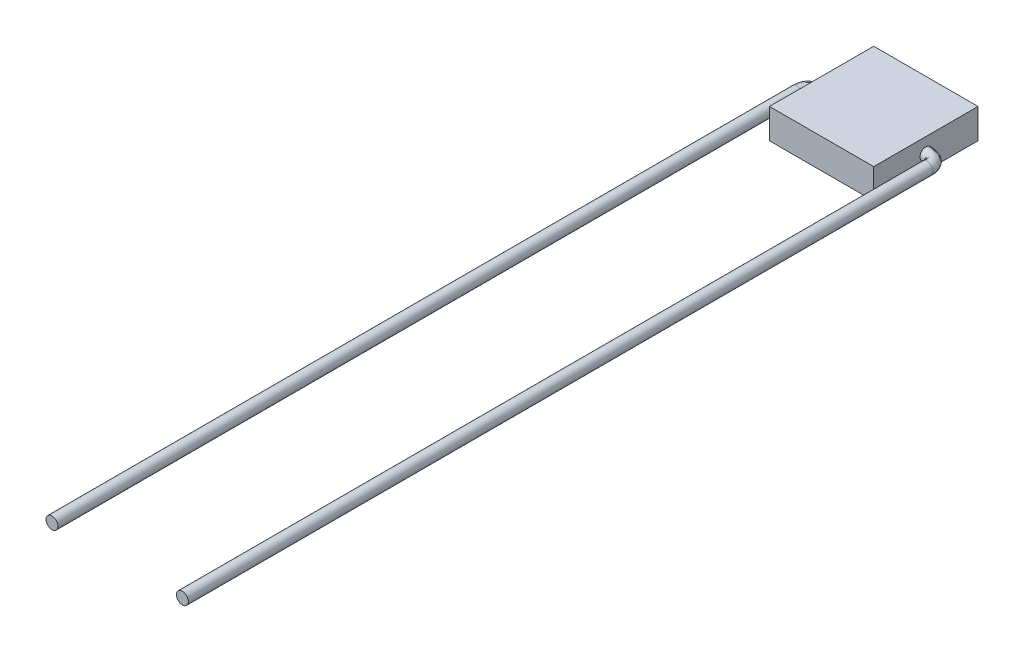
ISO-10303-21;
HEADER;
FILE_DESCRIPTION(('STEP AP214'),'2;1');
FILE_NAME('part.step','',(''),(''),'','','');
FILE_SCHEMA(('AUTOMOTIVE_DESIGN { 1 0 10303 214 1 1 1 1 }'));
ENDSEC;
DATA;
#1=APPLICATION_CONTEXT('core data for automotive mechanical design processes');
#2=APPLICATION_PROTOCOL_DEFINITION('international standard','automotive_design',2000,#1);
#3=PRODUCT_CONTEXT('',#1,'mechanical');
#4=PRODUCT('Part','Part','',(#3));
#5=PRODUCT_RELATED_PRODUCT_CATEGORY('part','',(#4));
#6=PRODUCT_DEFINITION_FORMATION('','',#4);
#7=PRODUCT_DEFINITION_CONTEXT('part definition',#1,'design');
#8=PRODUCT_DEFINITION('design','',#6,#7);
#9=PRODUCT_DEFINITION_SHAPE('','',#8);
#10=(LENGTH_UNIT() NAMED_UNIT(*) SI_UNIT(.MILLI.,.METRE.));
#11=(NAMED_UNIT(*) PLANE_ANGLE_UNIT() SI_UNIT($,.RADIAN.));
#12=(NAMED_UNIT(*) SI_UNIT($,.STERADIAN.) SOLID_ANGLE_UNIT());
#13=UNCERTAINTY_MEASURE_WITH_UNIT(LENGTH_MEASURE(1.E-05),#10,'distance_accuracy_value','');
#14=(GEOMETRIC_REPRESENTATION_CONTEXT(3) GLOBAL_UNCERTAINTY_ASSIGNED_CONTEXT((#13)) GLOBAL_UNIT_ASSIGNED_CONTEXT((#10,
#11,#12)) REPRESENTATION_CONTEXT('',''));
#15=CARTESIAN_POINT('',(0.,0.,0.));
#16=DIRECTION('',(0.,0.,1.));
#17=DIRECTION('',(1.,0.,0.));
#18=AXIS2_PLACEMENT_3D('',#15,#16,#17);
#19=CARTESIAN_POINT('',(-3.501,1.,-0.399999999999999));
#20=CARTESIAN_POINT('',(-3.56646782600625,1.,-0.39755730411981));
#21=CARTESIAN_POINT('',(-3.69185284114559,1.,-0.39287901436128));
#22=CARTESIAN_POINT('',(-3.88118886321808,1.,-0.364493104213795));
#23=CARTESIAN_POINT('',(-4.06161080445499,1.,-0.316892142088519));
#24=CARTESIAN_POINT('',(-4.23312358370174,1.,-0.245077929609848));
#25=CARTESIAN_POINT('',(-4.39217712534511,1.,-0.145202077715626));
#26=CARTESIAN_POINT('',(-4.53978133452972,1.,-0.00812376183653443));
#27=CARTESIAN_POINT('',(-4.66190402129707,1.,0.169362084409235));
#28=CARTESIAN_POINT('',(-4.74252724949883,1.,0.377519920231313));
#29=CARTESIAN_POINT('',(-4.78088929752952,1.,0.595196422765956));
#30=CARTESIAN_POINT('',(-4.77817081920847,1.,0.733264586087936));
#31=CARTESIAN_POINT('',(-4.77675207461588,1.,0.805320875301515));
#32=CARTESIAN_POINT('',(-3.501,1.8,-0.399999999999999));
#33=CARTESIAN_POINT('',(-3.56646782600626,1.8,-0.39755730411981));
#34=CARTESIAN_POINT('',(-3.69185284114559,1.8,-0.39287901436128));
#35=CARTESIAN_POINT('',(-3.88118886321808,1.8,-0.364493104213795));
#36=CARTESIAN_POINT('',(-4.06161080445499,1.8,-0.316892142088519));
#37=CARTESIAN_POINT('',(-4.23312358370174,1.8,-0.245077929609848));
#38=CARTESIAN_POINT('',(-4.39217712534511,1.8,-0.145202077715626));
#39=CARTESIAN_POINT('',(-4.53978133452972,1.8,-0.0081237618365347));
#40=CARTESIAN_POINT('',(-4.66190402129707,1.8,0.169362084409235));
#41=CARTESIAN_POINT('',(-4.74252724949883,1.8,0.377519920231313));
#42=CARTESIAN_POINT('',(-4.78088929752952,1.8,0.595196422765956));
#43=CARTESIAN_POINT('',(-4.77817081920847,1.8,0.733264586087936));
#44=CARTESIAN_POINT('',(-4.77675207461588,1.8,0.805320875301515));
#45=CARTESIAN_POINT('',(-3.501,1.8,0.400000000000001));
#46=CARTESIAN_POINT('',(-3.54524047836114,1.8,0.402052575954826));
#47=CARTESIAN_POINT('',(-3.62997054177509,1.8,0.405983701866138));
#48=CARTESIAN_POINT('',(-3.73669676239041,1.8,0.424079368187305));
#49=CARTESIAN_POINT('',(-3.81920029534562,1.8,0.448162313815962));
#50=CARTESIAN_POINT('',(-3.87711121417875,1.8,0.475402874293346));
#51=CARTESIAN_POINT('',(-3.91364694425438,1.8,0.50178322862157));
#52=CARTESIAN_POINT('',(-3.93670395517712,1.8,0.527297192400344));
#53=CARTESIAN_POINT('',(-3.95340882564816,1.8,0.555945947624282));
#54=CARTESIAN_POINT('',(-3.96924981858099,1.8,0.602357223756058));
#55=CARTESIAN_POINT('',(-3.98113071589947,1.8,0.675492594266937));
#56=CARTESIAN_POINT('',(-3.97846976825326,1.8,0.744618866099475));
#57=CARTESIAN_POINT('',(-3.97708104830101,1.8,0.780695123765089));
#58=CARTESIAN_POINT('',(-3.501,1.,0.400000000000001));
#59=CARTESIAN_POINT('',(-3.54524047836114,1.,0.402052575954826));
#60=CARTESIAN_POINT('',(-3.62997054177509,1.,0.405983701866138));
#61=CARTESIAN_POINT('',(-3.73669676239041,1.,0.424079368187305));
#62=CARTESIAN_POINT('',(-3.81920029534563,1.,0.448162313815961));
#63=CARTESIAN_POINT('',(-3.87711121417874,1.,0.475402874293346));
#64=CARTESIAN_POINT('',(-3.91364694425438,1.,0.501783228621569));
#65=CARTESIAN_POINT('',(-3.93670395517712,1.,0.527297192400344));
#66=CARTESIAN_POINT('',(-3.95340882564816,1.,0.555945947624282));
#67=CARTESIAN_POINT('',(-3.96924981858099,1.,0.602357223756058));
#68=CARTESIAN_POINT('',(-3.98113071589947,1.,0.675492594266937));
#69=CARTESIAN_POINT('',(-3.97846976825326,1.,0.744618866099475));
#70=CARTESIAN_POINT('',(-3.97708104830101,1.,0.780695123765089));
#71=CARTESIAN_POINT('',(-3.501,0.2,0.400000000000001));
#72=CARTESIAN_POINT('',(-3.54524047836114,0.2,0.402052575954826));
#73=CARTESIAN_POINT('',(-3.62997054177509,0.2,0.405983701866138));
#74=CARTESIAN_POINT('',(-3.73669676239041,0.2,0.424079368187305));
#75=CARTESIAN_POINT('',(-3.81920029534562,0.2,0.448162313815962));
#76=CARTESIAN_POINT('',(-3.87711121417875,0.2,0.475402874293346));
#77=CARTESIAN_POINT('',(-3.91364694425438,0.2,0.50178322862157));
#78=CARTESIAN_POINT('',(-3.93670395517712,0.2,0.527297192400344));
#79=CARTESIAN_POINT('',(-3.95340882564816,0.2,0.555945947624283));
#80=CARTESIAN_POINT('',(-3.96924981858099,0.2,0.602357223756057));
#81=CARTESIAN_POINT('',(-3.98113071589947,0.2,0.675492594266937));
#82=CARTESIAN_POINT('',(-3.97846976825326,0.2,0.744618866099475));
#83=CARTESIAN_POINT('',(-3.97708104830101,0.2,0.780695123765089));
#84=CARTESIAN_POINT('',(-3.501,0.2,-0.399999999999999));
#85=CARTESIAN_POINT('',(-3.56646782600626,0.2,-0.39755730411981));
#86=CARTESIAN_POINT('',(-3.69185284114559,0.2,-0.39287901436128));
#87=CARTESIAN_POINT('',(-3.88118886321808,0.2,-0.364493104213795));
#88=CARTESIAN_POINT('',(-4.06161080445499,0.2,-0.316892142088519));
#89=CARTESIAN_POINT('',(-4.23312358370174,0.2,-0.245077929609848));
#90=CARTESIAN_POINT('',(-4.39217712534511,0.2,-0.145202077715626));
#91=CARTESIAN_POINT('',(-4.53978133452972,0.2,-0.0081237618365347));
#92=CARTESIAN_POINT('',(-4.66190402129707,0.2,0.169362084409235));
#93=CARTESIAN_POINT('',(-4.74252724949883,0.2,0.377519920231313));
#94=CARTESIAN_POINT('',(-4.78088929752952,0.2,0.595196422765956));
#95=CARTESIAN_POINT('',(-4.77817081920847,0.2,0.733264586087936));
#96=CARTESIAN_POINT('',(-4.77675207461588,0.2,0.805320875301515));
#97=CARTESIAN_POINT('',(-3.501,1.,-0.399999999999999));
#98=CARTESIAN_POINT('',(-3.56646782600625,1.,-0.39755730411981));
#99=CARTESIAN_POINT('',(-3.69185284114559,1.,-0.39287901436128));
#100=CARTESIAN_POINT('',(-3.88118886321808,1.,-0.364493104213795));
#101=CARTESIAN_POINT('',(-4.06161080445499,1.,-0.316892142088519));
#102=CARTESIAN_POINT('',(-4.23312358370174,1.,-0.245077929609848));
#103=CARTESIAN_POINT('',(-4.39217712534511,1.,-0.145202077715626));
#104=CARTESIAN_POINT('',(-4.53978133452972,1.,-0.00812376183653443));
#105=CARTESIAN_POINT('',(-4.66190402129707,1.,0.169362084409235));
#106=CARTESIAN_POINT('',(-4.74252724949883,1.,0.377519920231313));
#107=CARTESIAN_POINT('',(-4.78088929752952,1.,0.595196422765956));
#108=CARTESIAN_POINT('',(-4.77817081920847,1.,0.733264586087936));
#109=CARTESIAN_POINT('',(-4.77675207461588,1.,0.805320875301515));
#110=(BOUNDED_SURFACE() B_SPLINE_SURFACE(3,3,((#19,#20,#21,#22,#23,#24,#25,#26,#27,#28,#29,#30,
#31),(#32,#33,#34,#35,#36,#37,#38,#39,#40,#41,#42,#43,#44),(#45,#46,#47,#48,#49,#50,#51,#52,#53,
#54,#55,#56,#57),(#58,#59,#60,#61,#62,#63,#64,#65,#66,#67,#68,#69,#70),(#71,#72,#73,#74,#75,#76,
#77,#78,#79,#80,#81,#82,#83),(#84,#85,#86,#87,#88,#89,#90,#91,#92,#93,#94,#95,#96),(#97,#98,#99,
#100,#101,#102,#103,#104,#105,#106,#107,#108,#109)),.UNSPECIFIED.,.T.,.F.,
.F.) B_SPLINE_SURFACE_WITH_KNOTS((4,3,4),(4,1,1,1,1,1,1,1,1,1,4),(0.,0.5,1.),(0.,
0.116131357521181,0.222416611474986,0.320137404051586,0.410906732244125,0.496658547709349,
0.579566355450047,0.676689324838823,0.776806012198351,0.883517458704345,1.),
.UNSPECIFIED.) GEOMETRIC_REPRESENTATION_ITEM() RATIONAL_B_SPLINE_SURFACE(((1.,1.,1.,1.,1.,1.,1.,
1.,1.,1.,1.,1.,1.),(0.333333333333333,0.333333333333333,0.333333333333333,0.333333333333333,
0.333333333333333,0.333333333333333,0.333333333333333,0.333333333333333,0.333333333333333,
0.333333333333333,0.333333333333333,0.333333333333333,0.333333333333333),(0.333333333333333,
0.333333333333333,0.333333333333333,0.333333333333333,0.333333333333333,0.333333333333333,
0.333333333333333,0.333333333333333,0.333333333333333,0.333333333333333,0.333333333333333,
0.333333333333333,0.333333333333333),(1.,1.,1.,1.,1.,1.,1.,1.,1.,1.,1.,1.,1.),
(0.333333333333333,0.333333333333333,0.333333333333333,0.333333333333333,0.333333333333333,
0.333333333333333,0.333333333333333,0.333333333333333,0.333333333333333,0.333333333333333,
0.333333333333333,0.333333333333333,0.333333333333333),(0.333333333333333,0.333333333333333,
0.333333333333333,0.333333333333333,0.333333333333333,0.333333333333333,0.333333333333333,
0.333333333333333,0.333333333333333,0.333333333333333,0.333333333333333,0.333333333333333,
0.333333333333333),(1.,1.,1.,1.,1.,1.,1.,1.,1.,1.,1.,1.,1.))) REPRESENTATION_ITEM('') SURFACE());
#111=CARTESIAN_POINT('',(-3.501,1.,0.));
#112=DIRECTION('',(1.,0.,0.));
#113=DIRECTION('',(0.,0.,-1.));
#114=AXIS2_PLACEMENT_3D('',#111,#112,#113);
#115=CIRCLE('',#114,0.4);
#116=CARTESIAN_POINT('',(-3.501,1.,-0.399999999999999));
#117=VERTEX_POINT('',#116);
#118=EDGE_CURVE('E13',#117,#117,#115,.T.);
#119=CARTESIAN_POINT('',(-4.77675207461588,1.,0.805320875301515));
#120=CARTESIAN_POINT('',(-4.77675207461588,0.2,0.805320875301515));
#121=CARTESIAN_POINT('',(-3.97708104830101,0.2,0.780695123765089));
#122=CARTESIAN_POINT('',(-3.97708104830101,1.,0.780695123765089));
#123=CARTESIAN_POINT('',(-3.97708104830101,1.8,0.780695123765089));
#124=CARTESIAN_POINT('',(-4.77675207461588,1.8,0.805320875301515));
#125=CARTESIAN_POINT('',(-4.77675207461588,1.,0.805320875301515));
#126=(BOUNDED_CURVE() B_SPLINE_CURVE(3,(#119,#120,#121,#122,#123,#124,#125),.UNSPECIFIED.,.T.,
.F.) B_SPLINE_CURVE_WITH_KNOTS((4,3,4),(0.,0.5,1.),
.UNSPECIFIED.) CURVE() GEOMETRIC_REPRESENTATION_ITEM() RATIONAL_B_SPLINE_CURVE((1.,
0.333333333333333,0.333333333333333,1.,0.333333333333333,0.333333333333333,1.)) REPRESENTATION_ITEM(''));
#127=CARTESIAN_POINT('',(-4.77675207461588,1.,0.805320875301515));
#128=VERTEX_POINT('',#127);
#129=EDGE_CURVE('E70',#128,#128,#126,.T.);
#130=ORIENTED_EDGE('',*,*,#118,.F.);
#131=EDGE_LOOP('',(#130));
#132=FACE_BOUND('',#131,.T.);
#133=ORIENTED_EDGE('',*,*,#129,.F.);
#134=EDGE_LOOP('',(#133));
#135=FACE_BOUND('',#134,.T.);
#136=ADVANCED_FACE('F58',(#132,#135),#110,.F.);
#137=CARTESIAN_POINT('',(-3.501,1.,0.));
#138=DIRECTION('',(-1.,0.,0.));
#139=DIRECTION('',(0.,0.,-1.));
#140=AXIS2_PLACEMENT_3D('',#137,#138,#139);
#141=PLANE('',#140);
#142=ORIENTED_EDGE('',*,*,#118,.T.);
#143=EDGE_LOOP('',(#142));
#144=FACE_BOUND('',#143,.T.);
#145=ADVANCED_FACE('F90',(#144),#141,.F.);
#146=CARTESIAN_POINT('',(-3.97708104830101,1.,50.7930079995333));
#147=DIRECTION('',(0.,0.,1.));
#148=DIRECTION('',(-1.,0.,0.));
#149=AXIS2_PLACEMENT_3D('',#146,#147,#148);
#150=PLANE('',#149);
#151=CARTESIAN_POINT('',(-4.77675207461588,1.,50.7930079995333));
#152=CARTESIAN_POINT('',(-4.77675207461588,0.2,50.7930079995333));
#153=CARTESIAN_POINT('',(-3.977081048301,0.2,50.7930079995333));
#154=CARTESIAN_POINT('',(-3.97708104830101,1.,50.7930079995333));
#155=CARTESIAN_POINT('',(-3.977081048301,1.8,50.7930079995333));
#156=CARTESIAN_POINT('',(-4.77675207461588,1.8,50.7930079995333));
#157=CARTESIAN_POINT('',(-4.77675207461588,1.,50.7930079995333));
#158=(BOUNDED_CURVE() B_SPLINE_CURVE(3,(#151,#152,#153,#154,#155,#156,#157),.UNSPECIFIED.,.T.,
.F.) B_SPLINE_CURVE_WITH_KNOTS((4,3,4),(0.,0.5,1.),
.UNSPECIFIED.) CURVE() GEOMETRIC_REPRESENTATION_ITEM() RATIONAL_B_SPLINE_CURVE((1.,
0.333333333333333,0.333333333333333,1.,0.333333333333333,0.333333333333333,1.)) REPRESENTATION_ITEM(''));
#159=CARTESIAN_POINT('',(-4.77675207461588,1.,50.7930079995333));
#160=VERTEX_POINT('',#159);
#161=EDGE_CURVE('E66',#160,#160,#158,.F.);
#162=ORIENTED_EDGE('',*,*,#161,.F.);
#163=EDGE_LOOP('',(#162));
#164=FACE_BOUND('',#163,.T.);
#165=ADVANCED_FACE('F95',(#164),#150,.T.);
#166=CARTESIAN_POINT('',(-4.77675207461588,1.,0.805320875301515));
#167=CARTESIAN_POINT('',(-4.77675207461588,1.,50.7930079995333));
#168=CARTESIAN_POINT('',(-4.77675207461588,0.2,0.805320875301515));
#169=CARTESIAN_POINT('',(-4.77675207461588,0.2,50.7930079995333));
#170=CARTESIAN_POINT('',(-3.97708104830101,0.2,0.780695123765089));
#171=CARTESIAN_POINT('',(-3.977081048301,0.2,50.7930079995333));
#172=CARTESIAN_POINT('',(-3.97708104830101,1.,0.780695123765089));
#173=CARTESIAN_POINT('',(-3.97708104830101,1.,50.7930079995333));
#174=CARTESIAN_POINT('',(-3.97708104830101,1.8,0.780695123765089));
#175=CARTESIAN_POINT('',(-3.977081048301,1.8,50.7930079995333));
#176=CARTESIAN_POINT('',(-4.77675207461588,1.8,0.805320875301515));
#177=CARTESIAN_POINT('',(-4.77675207461588,1.8,50.7930079995333));
#178=CARTESIAN_POINT('',(-4.77675207461588,1.,0.805320875301515));
#179=CARTESIAN_POINT('',(-4.77675207461588,1.,50.7930079995333));
#180=(BOUNDED_SURFACE() B_SPLINE_SURFACE(3,1,((#166,#167),(#168,#169),(#170,#171),(#172,#173),
(#174,#175),(#176,#177),(#178,#179)),.UNSPECIFIED.,.T.,.F.,.F.) B_SPLINE_SURFACE_WITH_KNOTS((4,
3,4),(2,2),(0.,0.5,1.),(0.,1.),
.UNSPECIFIED.) GEOMETRIC_REPRESENTATION_ITEM() RATIONAL_B_SPLINE_SURFACE(((1.,1.),
(0.333333333333333,0.333333333333333),(0.333333333333333,0.333333333333333),(1.,1.),
(0.333333333333333,0.333333333333333),(0.333333333333333,0.333333333333333),(1.,1.))) REPRESENTATION_ITEM('') SURFACE());
#181=ORIENTED_EDGE('',*,*,#129,.T.);
#182=EDGE_LOOP('',(#181));
#183=FACE_BOUND('',#182,.T.);
#184=ORIENTED_EDGE('',*,*,#161,.T.);
#185=EDGE_LOOP('',(#184));
#186=FACE_BOUND('',#185,.T.);
#187=ADVANCED_FACE('F87',(#183,#186),#180,.T.);
#188=CLOSED_SHELL('',(#136,#145,#165,#187));
#189=MANIFOLD_SOLID_BREP('B2',#188);
#190=CARTESIAN_POINT('',(3.501,1.,-0.4));
#191=CARTESIAN_POINT('',(3.56646782600625,1.,-0.397557304119811));
#192=CARTESIAN_POINT('',(3.69185284114559,1.,-0.39287901436128));
#193=CARTESIAN_POINT('',(3.88118886321808,1.,-0.364493104213796));
#194=CARTESIAN_POINT('',(4.06161080445499,1.,-0.31689214208852));
#195=CARTESIAN_POINT('',(4.23312358370174,1.,-0.245077929609848));
#196=CARTESIAN_POINT('',(4.39217712534511,1.,-0.145202077715627));
#197=CARTESIAN_POINT('',(4.53978133452972,1.,-0.00812376183653499));
#198=CARTESIAN_POINT('',(4.66190402129707,1.,0.169362084409234));
#199=CARTESIAN_POINT('',(4.74252724949883,1.,0.377519920231312));
#200=CARTESIAN_POINT('',(4.78088929752952,1.,0.595196422765956));
#201=CARTESIAN_POINT('',(4.77817081920847,1.,0.733264586087935));
#202=CARTESIAN_POINT('',(4.77675207461588,1.,0.805320875301515));
#203=CARTESIAN_POINT('',(3.501,1.8,-0.4));
#204=CARTESIAN_POINT('',(3.56646782600626,1.8,-0.397557304119811));
#205=CARTESIAN_POINT('',(3.69185284114559,1.8,-0.39287901436128));
#206=CARTESIAN_POINT('',(3.88118886321808,1.8,-0.364493104213796));
#207=CARTESIAN_POINT('',(4.06161080445499,1.8,-0.316892142088519));
#208=CARTESIAN_POINT('',(4.23312358370174,1.8,-0.245077929609848));
#209=CARTESIAN_POINT('',(4.39217712534511,1.8,-0.145202077715626));
#210=CARTESIAN_POINT('',(4.53978133452972,1.8,-0.00812376183653526));
#211=CARTESIAN_POINT('',(4.66190402129707,1.8,0.169362084409234));
#212=CARTESIAN_POINT('',(4.74252724949883,1.8,0.377519920231312));
#213=CARTESIAN_POINT('',(4.78088929752952,1.8,0.595196422765956));
#214=CARTESIAN_POINT('',(4.77817081920847,1.8,0.733264586087935));
#215=CARTESIAN_POINT('',(4.77675207461588,1.8,0.805320875301515));
#216=CARTESIAN_POINT('',(3.501,1.8,0.4));
#217=CARTESIAN_POINT('',(3.54524047836114,1.8,0.402052575954826));
#218=CARTESIAN_POINT('',(3.62997054177509,1.8,0.405983701866138));
#219=CARTESIAN_POINT('',(3.73669676239041,1.8,0.424079368187304));
#220=CARTESIAN_POINT('',(3.81920029534562,1.8,0.448162313815961));
#221=CARTESIAN_POINT('',(3.87711121417875,1.8,0.475402874293346));
#222=CARTESIAN_POINT('',(3.91364694425438,1.8,0.501783228621569));
#223=CARTESIAN_POINT('',(3.93670395517712,1.8,0.527297192400344));
#224=CARTESIAN_POINT('',(3.95340882564816,1.8,0.555945947624281));
#225=CARTESIAN_POINT('',(3.96924981858099,1.8,0.602357223756057));
#226=CARTESIAN_POINT('',(3.98113071589947,1.8,0.675492594266936));
#227=CARTESIAN_POINT('',(3.97846976825326,1.8,0.744618866099474));
#228=CARTESIAN_POINT('',(3.97708104830101,1.8,0.780695123765089));
#229=CARTESIAN_POINT('',(3.501,1.,0.4));
#230=CARTESIAN_POINT('',(3.54524047836114,1.,0.402052575954826));
#231=CARTESIAN_POINT('',(3.62997054177509,1.,0.405983701866137));
#232=CARTESIAN_POINT('',(3.73669676239041,1.,0.424079368187305));
#233=CARTESIAN_POINT('',(3.81920029534563,1.,0.448162313815961));
#234=CARTESIAN_POINT('',(3.87711121417874,1.,0.475402874293346));
#235=CARTESIAN_POINT('',(3.91364694425438,1.,0.501783228621569));
#236=CARTESIAN_POINT('',(3.93670395517712,1.,0.527297192400344));
#237=CARTESIAN_POINT('',(3.95340882564816,1.,0.555945947624281));
#238=CARTESIAN_POINT('',(3.96924981858099,1.,0.602357223756057));
#239=CARTESIAN_POINT('',(3.98113071589947,1.,0.675492594266936));
#240=CARTESIAN_POINT('',(3.97846976825326,1.,0.744618866099474));
#241=CARTESIAN_POINT('',(3.97708104830101,1.,0.780695123765089));
#242=CARTESIAN_POINT('',(3.501,0.2,0.4));
#243=CARTESIAN_POINT('',(3.54524047836114,0.2,0.402052575954826));
#244=CARTESIAN_POINT('',(3.62997054177509,0.2,0.405983701866138));
#245=CARTESIAN_POINT('',(3.73669676239041,0.2,0.424079368187305));
#246=CARTESIAN_POINT('',(3.81920029534562,0.2,0.448162313815961));
#247=CARTESIAN_POINT('',(3.87711121417875,0.2,0.475402874293346));
#248=CARTESIAN_POINT('',(3.91364694425438,0.2,0.50178322862157));
#249=CARTESIAN_POINT('',(3.93670395517712,0.2,0.527297192400344));
#250=CARTESIAN_POINT('',(3.95340882564816,0.2,0.555945947624282));
#251=CARTESIAN_POINT('',(3.96924981858099,0.2,0.602357223756057));
#252=CARTESIAN_POINT('',(3.98113071589947,0.2,0.675492594266937));
#253=CARTESIAN_POINT('',(3.97846976825326,0.2,0.744618866099474));
#254=CARTESIAN_POINT('',(3.97708104830101,0.2,0.780695123765089));
#255=CARTESIAN_POINT('',(3.501,0.2,-0.4));
#256=CARTESIAN_POINT('',(3.56646782600626,0.2,-0.397557304119811));
#257=CARTESIAN_POINT('',(3.69185284114559,0.2,-0.39287901436128));
#258=CARTESIAN_POINT('',(3.88118886321808,0.2,-0.364493104213796));
#259=CARTESIAN_POINT('',(4.06161080445499,0.2,-0.316892142088519));
#260=CARTESIAN_POINT('',(4.23312358370174,0.2,-0.245077929609848));
#261=CARTESIAN_POINT('',(4.39217712534511,0.2,-0.145202077715626));
#262=CARTESIAN_POINT('',(4.53978133452972,0.2,-0.00812376183653526));
#263=CARTESIAN_POINT('',(4.66190402129707,0.2,0.169362084409234));
#264=CARTESIAN_POINT('',(4.74252724949883,0.2,0.377519920231312));
#265=CARTESIAN_POINT('',(4.78088929752952,0.2,0.595196422765956));
#266=CARTESIAN_POINT('',(4.77817081920847,0.2,0.733264586087935));
#267=CARTESIAN_POINT('',(4.77675207461588,0.2,0.805320875301515));
#268=CARTESIAN_POINT('',(3.501,1.,-0.4));
#269=CARTESIAN_POINT('',(3.56646782600625,1.,-0.397557304119811));
#270=CARTESIAN_POINT('',(3.69185284114559,1.,-0.39287901436128));
#271=CARTESIAN_POINT('',(3.88118886321808,1.,-0.364493104213796));
#272=CARTESIAN_POINT('',(4.06161080445499,1.,-0.31689214208852));
#273=CARTESIAN_POINT('',(4.23312358370174,1.,-0.245077929609848));
#274=CARTESIAN_POINT('',(4.39217712534511,1.,-0.145202077715627));
#275=CARTESIAN_POINT('',(4.53978133452972,1.,-0.00812376183653499));
#276=CARTESIAN_POINT('',(4.66190402129707,1.,0.169362084409234));
#277=CARTESIAN_POINT('',(4.74252724949883,1.,0.377519920231312));
#278=CARTESIAN_POINT('',(4.78088929752952,1.,0.595196422765956));
#279=CARTESIAN_POINT('',(4.77817081920847,1.,0.733264586087935));
#280=CARTESIAN_POINT('',(4.77675207461588,1.,0.805320875301515));
#281=(BOUNDED_SURFACE() B_SPLINE_SURFACE(3,3,((#190,#191,#192,#193,#194,#195,#196,#197,#198,
#199,#200,#201,#202),(#203,#204,#205,#206,#207,#208,#209,#210,#211,#212,#213,#214,#215),(#216,
#217,#218,#219,#220,#221,#222,#223,#224,#225,#226,#227,#228),(#229,#230,#231,#232,#233,#234,
#235,#236,#237,#238,#239,#240,#241),(#242,#243,#244,#245,#246,#247,#248,#249,#250,#251,#252,
#253,#254),(#255,#256,#257,#258,#259,#260,#261,#262,#263,#264,#265,#266,#267),(#268,#269,#270,
#271,#272,#273,#274,#275,#276,#277,#278,#279,#280)),.UNSPECIFIED.,.T.,.F.,
.F.) B_SPLINE_SURFACE_WITH_KNOTS((4,3,4),(4,1,1,1,1,1,1,1,1,1,4),(0.,0.5,1.),(0.,
0.116131357521181,0.222416611474986,0.320137404051586,0.410906732244125,0.496658547709349,
0.579566355450047,0.676689324838823,0.776806012198351,0.883517458704345,1.),
.UNSPECIFIED.) GEOMETRIC_REPRESENTATION_ITEM() RATIONAL_B_SPLINE_SURFACE(((1.,1.,1.,1.,1.,1.,1.,
1.,1.,1.,1.,1.,1.),(0.333333333333333,0.333333333333333,0.333333333333333,0.333333333333333,
0.333333333333333,0.333333333333333,0.333333333333333,0.333333333333333,0.333333333333333,
0.333333333333333,0.333333333333333,0.333333333333333,0.333333333333333),(0.333333333333333,
0.333333333333333,0.333333333333333,0.333333333333333,0.333333333333333,0.333333333333333,
0.333333333333333,0.333333333333333,0.333333333333333,0.333333333333333,0.333333333333333,
0.333333333333333,0.333333333333333),(1.,1.,1.,1.,1.,1.,1.,1.,1.,1.,1.,1.,1.),
(0.333333333333333,0.333333333333333,0.333333333333333,0.333333333333333,0.333333333333333,
0.333333333333333,0.333333333333333,0.333333333333333,0.333333333333333,0.333333333333333,
0.333333333333333,0.333333333333333,0.333333333333333),(0.333333333333333,0.333333333333333,
0.333333333333333,0.333333333333333,0.333333333333333,0.333333333333333,0.333333333333333,
0.333333333333333,0.333333333333333,0.333333333333333,0.333333333333333,0.333333333333333,
0.333333333333333),(1.,1.,1.,1.,1.,1.,1.,1.,1.,1.,1.,1.,1.))) REPRESENTATION_ITEM('') SURFACE());
#282=CARTESIAN_POINT('',(3.501,1.,0.));
#283=DIRECTION('',(1.,0.,0.));
#284=DIRECTION('',(0.,0.,-1.));
#285=AXIS2_PLACEMENT_3D('',#282,#283,#284);
#286=CIRCLE('',#285,0.4);
#287=CARTESIAN_POINT('',(3.501,1.,-0.4));
#288=VERTEX_POINT('',#287);
#289=EDGE_CURVE('E57',#288,#288,#286,.T.);
#290=CARTESIAN_POINT('',(4.77675207461588,1.,0.805320875301515));
#291=CARTESIAN_POINT('',(4.77675207461588,0.2,0.805320875301515));
#292=CARTESIAN_POINT('',(3.97708104830101,0.2,0.780695123765089));
#293=CARTESIAN_POINT('',(3.97708104830101,1.,0.780695123765089));
#294=CARTESIAN_POINT('',(3.97708104830101,1.8,0.780695123765089));
#295=CARTESIAN_POINT('',(4.77675207461588,1.8,0.805320875301515));
#296=CARTESIAN_POINT('',(4.77675207461588,1.,0.805320875301515));
#297=(BOUNDED_CURVE() B_SPLINE_CURVE(3,(#290,#291,#292,#293,#294,#295,#296),.UNSPECIFIED.,.T.,
.F.) B_SPLINE_CURVE_WITH_KNOTS((4,3,4),(0.,0.5,1.),
.UNSPECIFIED.) CURVE() GEOMETRIC_REPRESENTATION_ITEM() RATIONAL_B_SPLINE_CURVE((1.,
0.333333333333333,0.333333333333333,1.,0.333333333333333,0.333333333333333,1.)) REPRESENTATION_ITEM(''));
#298=CARTESIAN_POINT('',(4.77675207461588,1.,0.805320875301515));
#299=VERTEX_POINT('',#298);
#300=EDGE_CURVE('E165',#299,#299,#297,.T.);
#301=ORIENTED_EDGE('',*,*,#289,.T.);
#302=EDGE_LOOP('',(#301));
#303=FACE_BOUND('',#302,.T.);
#304=ORIENTED_EDGE('',*,*,#300,.T.);
#305=EDGE_LOOP('',(#304));
#306=FACE_BOUND('',#305,.T.);
#307=ADVANCED_FACE('F153',(#303,#306),#281,.T.);
#308=CARTESIAN_POINT('',(3.501,1.,0.));
#309=DIRECTION('',(1.,0.,0.));
#310=DIRECTION('',(0.,0.,-1.));
#311=AXIS2_PLACEMENT_3D('',#308,#309,#310);
#312=PLANE('',#311);
#313=ORIENTED_EDGE('',*,*,#289,.F.);
#314=EDGE_LOOP('',(#313));
#315=FACE_BOUND('',#314,.T.);
#316=ADVANCED_FACE('F191',(#315),#312,.F.);
#317=CARTESIAN_POINT('',(3.97708104830101,1.,50.7930079995333));
#318=DIRECTION('',(0.,0.,1.));
#319=DIRECTION('',(1.,0.,0.));
#320=AXIS2_PLACEMENT_3D('',#317,#318,#319);
#321=PLANE('',#320);
#322=CARTESIAN_POINT('',(4.77675207461589,1.,50.7930079995333));
#323=CARTESIAN_POINT('',(4.77675207461589,0.2,50.7930079995333));
#324=CARTESIAN_POINT('',(3.97708104830101,0.2,50.7930079995333));
#325=CARTESIAN_POINT('',(3.97708104830101,1.,50.7930079995333));
#326=CARTESIAN_POINT('',(3.97708104830101,1.8,50.7930079995333));
#327=CARTESIAN_POINT('',(4.77675207461589,1.8,50.7930079995333));
#328=CARTESIAN_POINT('',(4.77675207461589,1.,50.7930079995333));
#329=(BOUNDED_CURVE() B_SPLINE_CURVE(3,(#322,#323,#324,#325,#326,#327,#328),.UNSPECIFIED.,.T.,
.F.) B_SPLINE_CURVE_WITH_KNOTS((4,3,4),(0.,0.5,1.),
.UNSPECIFIED.) CURVE() GEOMETRIC_REPRESENTATION_ITEM() RATIONAL_B_SPLINE_CURVE((1.,
0.333333333333333,0.333333333333333,1.,0.333333333333333,0.333333333333333,1.)) REPRESENTATION_ITEM(''));
#330=CARTESIAN_POINT('',(4.77675207461589,1.,50.7930079995333));
#331=VERTEX_POINT('',#330);
#332=EDGE_CURVE('E161',#331,#331,#329,.F.);
#333=ORIENTED_EDGE('',*,*,#332,.T.);
#334=EDGE_LOOP('',(#333));
#335=FACE_BOUND('',#334,.T.);
#336=ADVANCED_FACE('F186',(#335),#321,.T.);
#337=CARTESIAN_POINT('',(4.77675207461588,1.,0.805320875301515));
#338=CARTESIAN_POINT('',(4.77675207461589,1.,50.7930079995333));
#339=CARTESIAN_POINT('',(4.77675207461588,0.2,0.805320875301515));
#340=CARTESIAN_POINT('',(4.77675207461589,0.2,50.7930079995333));
#341=CARTESIAN_POINT('',(3.97708104830101,0.2,0.780695123765089));
#342=CARTESIAN_POINT('',(3.97708104830101,0.2,50.7930079995333));
#343=CARTESIAN_POINT('',(3.97708104830101,1.,0.780695123765089));
#344=CARTESIAN_POINT('',(3.97708104830101,1.,50.7930079995333));
#345=CARTESIAN_POINT('',(3.97708104830101,1.8,0.780695123765089));
#346=CARTESIAN_POINT('',(3.97708104830101,1.8,50.7930079995333));
#347=CARTESIAN_POINT('',(4.77675207461588,1.8,0.805320875301515));
#348=CARTESIAN_POINT('',(4.77675207461589,1.8,50.7930079995333));
#349=CARTESIAN_POINT('',(4.77675207461588,1.,0.805320875301515));
#350=CARTESIAN_POINT('',(4.77675207461589,1.,50.7930079995333));
#351=(BOUNDED_SURFACE() B_SPLINE_SURFACE(3,1,((#337,#338),(#339,#340),(#341,#342),(#343,#344),
(#345,#346),(#347,#348),(#349,#350)),.UNSPECIFIED.,.T.,.F.,.F.) B_SPLINE_SURFACE_WITH_KNOTS((4,
3,4),(2,2),(0.,0.5,1.),(0.,1.),
.UNSPECIFIED.) GEOMETRIC_REPRESENTATION_ITEM() RATIONAL_B_SPLINE_SURFACE(((1.,1.),
(0.333333333333333,0.333333333333333),(0.333333333333333,0.333333333333333),(1.,1.),
(0.333333333333333,0.333333333333333),(0.333333333333333,0.333333333333333),(1.,1.))) REPRESENTATION_ITEM('') SURFACE());
#352=ORIENTED_EDGE('',*,*,#300,.F.);
#353=EDGE_LOOP('',(#352));
#354=FACE_BOUND('',#353,.T.);
#355=ORIENTED_EDGE('',*,*,#332,.F.);
#356=EDGE_LOOP('',(#355));
#357=FACE_BOUND('',#356,.T.);
#358=ADVANCED_FACE('F183',(#354,#357),#351,.F.);
#359=CLOSED_SHELL('',(#307,#316,#336,#358));
#360=MANIFOLD_SOLID_BREP('B8',#359);
#361=CARTESIAN_POINT('',(-3.5,2.,-3.5));
#362=DIRECTION('',(1.,0.,0.));
#363=DIRECTION('',(0.,0.,-1.));
#364=AXIS2_PLACEMENT_3D('',#361,#362,#363);
#365=PLANE('',#364);
#366=DIRECTION('',(0.,0.,1.));
#367=VECTOR('',#366,1.);
#368=CARTESIAN_POINT('',(-3.5,0.,-3.5));
#369=LINE('',#368,#367);
#370=CARTESIAN_POINT('',(-3.5,0.,-3.5));
#371=VERTEX_POINT('',#370);
#372=CARTESIAN_POINT('',(-3.5,0.,3.5));
#373=VERTEX_POINT('',#372);
#374=EDGE_CURVE('E295',#371,#373,#369,.T.);
#375=ORIENTED_EDGE('',*,*,#374,.T.);
#376=DIRECTION('',(0.,-1.,0.));
#377=VECTOR('',#376,1.);
#378=CARTESIAN_POINT('',(-3.5,2.,3.5));
#379=LINE('',#378,#377);
#380=CARTESIAN_POINT('',(-3.5,2.,3.5));
#381=VERTEX_POINT('',#380);
#382=EDGE_CURVE('E151',#381,#373,#379,.T.);
#383=ORIENTED_EDGE('',*,*,#382,.F.);
#384=DIRECTION('',(0.,0.,1.));
#385=VECTOR('',#384,1.);
#386=CARTESIAN_POINT('',(-3.5,2.,-3.5));
#387=LINE('',#386,#385);
#388=CARTESIAN_POINT('',(-3.5,2.,-3.5));
#389=VERTEX_POINT('',#388);
#390=EDGE_CURVE('E283',#389,#381,#387,.T.);
#391=ORIENTED_EDGE('',*,*,#390,.F.);
#392=DIRECTION('',(0.,-1.,0.));
#393=VECTOR('',#392,1.);
#394=CARTESIAN_POINT('',(-3.5,2.,-3.5));
#395=LINE('',#394,#393);
#396=EDGE_CURVE('E291',#389,#371,#395,.T.);
#397=ORIENTED_EDGE('',*,*,#396,.T.);
#398=EDGE_LOOP('',(#375,#383,#391,#397));
#399=FACE_BOUND('',#398,.T.);
#400=ADVANCED_FACE('F232',(#399),#365,.F.);
#401=CARTESIAN_POINT('',(-3.5,2.,3.5));
#402=DIRECTION('',(0.,0.,-1.));
#403=DIRECTION('',(-1.,0.,0.));
#404=AXIS2_PLACEMENT_3D('',#401,#402,#403);
#405=PLANE('',#404);
#406=DIRECTION('',(1.,0.,0.));
#407=VECTOR('',#406,1.);
#408=CARTESIAN_POINT('',(-3.5,0.,3.5));
#409=LINE('',#408,#407);
#410=CARTESIAN_POINT('',(3.5,0.,3.5));
#411=VERTEX_POINT('',#410);
#412=EDGE_CURVE('E287',#373,#411,#409,.T.);
#413=ORIENTED_EDGE('',*,*,#412,.T.);
#414=DIRECTION('',(0.,-1.,0.));
#415=VECTOR('',#414,1.);
#416=CARTESIAN_POINT('',(3.5,2.,3.5));
#417=LINE('',#416,#415);
#418=CARTESIAN_POINT('',(3.5,2.,3.5));
#419=VERTEX_POINT('',#418);
#420=EDGE_CURVE('E240',#419,#411,#417,.T.);
#421=ORIENTED_EDGE('',*,*,#420,.F.);
#422=DIRECTION('',(1.,0.,0.));
#423=VECTOR('',#422,1.);
#424=CARTESIAN_POINT('',(-3.5,2.,3.5));
#425=LINE('',#424,#423);
#426=EDGE_CURVE('E278',#381,#419,#425,.T.);
#427=ORIENTED_EDGE('',*,*,#426,.F.);
#428=ORIENTED_EDGE('',*,*,#382,.T.);
#429=EDGE_LOOP('',(#413,#421,#427,#428));
#430=FACE_BOUND('',#429,.T.);
#431=ADVANCED_FACE('F286',(#430),#405,.F.);
#432=CARTESIAN_POINT('',(3.5,2.,-3.5));
#433=DIRECTION('',(-1.,0.,0.));
#434=DIRECTION('',(0.,0.,1.));
#435=AXIS2_PLACEMENT_3D('',#432,#433,#434);
#436=PLANE('',#435);
#437=DIRECTION('',(0.,0.,-1.));
#438=VECTOR('',#437,1.);
#439=CARTESIAN_POINT('',(3.5,0.,-3.5));
#440=LINE('',#439,#438);
#441=CARTESIAN_POINT('',(3.5,0.,-3.5));
#442=VERTEX_POINT('',#441);
#443=EDGE_CURVE('E265',#411,#442,#440,.T.);
#444=ORIENTED_EDGE('',*,*,#443,.T.);
#445=DIRECTION('',(0.,-1.,0.));
#446=VECTOR('',#445,1.);
#447=CARTESIAN_POINT('',(3.5,2.,-3.5));
#448=LINE('',#447,#446);
#449=CARTESIAN_POINT('',(3.5,2.,-3.5));
#450=VERTEX_POINT('',#449);
#451=EDGE_CURVE('E288',#450,#442,#448,.T.);
#452=ORIENTED_EDGE('',*,*,#451,.F.);
#453=DIRECTION('',(0.,0.,-1.));
#454=VECTOR('',#453,1.);
#455=CARTESIAN_POINT('',(3.5,2.,-3.5));
#456=LINE('',#455,#454);
#457=EDGE_CURVE('E281',#419,#450,#456,.T.);
#458=ORIENTED_EDGE('',*,*,#457,.F.);
#459=ORIENTED_EDGE('',*,*,#420,.T.);
#460=EDGE_LOOP('',(#444,#452,#458,#459));
#461=FACE_BOUND('',#460,.T.);
#462=ADVANCED_FACE('F289',(#461),#436,.F.);
#463=CARTESIAN_POINT('',(-3.5,2.,-3.5));
#464=DIRECTION('',(0.,0.,1.));
#465=DIRECTION('',(1.,0.,0.));
#466=AXIS2_PLACEMENT_3D('',#463,#464,#465);
#467=PLANE('',#466);
#468=DIRECTION('',(-1.,0.,0.));
#469=VECTOR('',#468,1.);
#470=CARTESIAN_POINT('',(-3.5,0.,-3.5));
#471=LINE('',#470,#469);
#472=EDGE_CURVE('E271',#442,#371,#471,.T.);
#473=ORIENTED_EDGE('',*,*,#472,.T.);
#474=ORIENTED_EDGE('',*,*,#396,.F.);
#475=DIRECTION('',(-1.,0.,0.));
#476=VECTOR('',#475,1.);
#477=CARTESIAN_POINT('',(-3.5,2.,-3.5));
#478=LINE('',#477,#476);
#479=EDGE_CURVE('E248',#450,#389,#478,.T.);
#480=ORIENTED_EDGE('',*,*,#479,.F.);
#481=ORIENTED_EDGE('',*,*,#451,.T.);
#482=EDGE_LOOP('',(#473,#474,#480,#481));
#483=FACE_BOUND('',#482,.T.);
#484=ADVANCED_FACE('F302',(#483),#467,.F.);
#485=CARTESIAN_POINT('',(0.,2.,0.));
#486=DIRECTION('',(0.,1.,0.));
#487=DIRECTION('',(0.,0.,1.));
#488=AXIS2_PLACEMENT_3D('',#485,#486,#487);
#489=PLANE('',#488);
#490=ORIENTED_EDGE('',*,*,#390,.T.);
#491=ORIENTED_EDGE('',*,*,#426,.T.);
#492=ORIENTED_EDGE('',*,*,#457,.T.);
#493=ORIENTED_EDGE('',*,*,#479,.T.);
#494=EDGE_LOOP('',(#490,#491,#492,#493));
#495=FACE_BOUND('',#494,.T.);
#496=ADVANCED_FACE('F279',(#495),#489,.T.);
#497=CARTESIAN_POINT('',(0.,0.,0.));
#498=DIRECTION('',(0.,1.,0.));
#499=DIRECTION('',(0.,0.,1.));
#500=AXIS2_PLACEMENT_3D('',#497,#498,#499);
#501=PLANE('',#500);
#502=ORIENTED_EDGE('',*,*,#374,.F.);
#503=ORIENTED_EDGE('',*,*,#472,.F.);
#504=ORIENTED_EDGE('',*,*,#443,.F.);
#505=ORIENTED_EDGE('',*,*,#412,.F.);
#506=EDGE_LOOP('',(#502,#503,#504,#505));
#507=FACE_BOUND('',#506,.T.);
#508=ADVANCED_FACE('F305',(#507),#501,.F.);
#509=CLOSED_SHELL('',(#400,#431,#462,#484,#496,#508));
#510=MANIFOLD_SOLID_BREP('B52',#509);
#511=ADVANCED_BREP_SHAPE_REPRESENTATION('',(#18,#189,#360,#510),#14);
#512=SHAPE_DEFINITION_REPRESENTATION(#9,#511);
ENDSEC;
END-ISO-10303-21;
